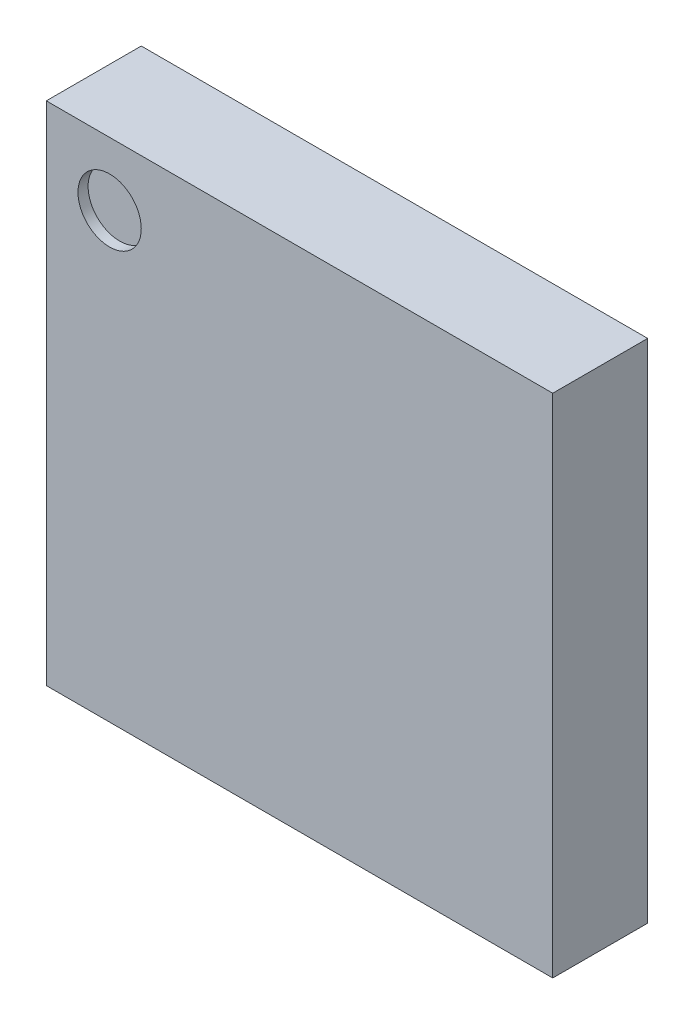
ISO-10303-21;
HEADER;
FILE_DESCRIPTION(('STEP AP214'),'2;1');
FILE_NAME('part.step','',(''),(''),'','','');
FILE_SCHEMA(('AUTOMOTIVE_DESIGN { 1 0 10303 214 1 1 1 1 }'));
ENDSEC;
DATA;
#1=APPLICATION_CONTEXT('core data for automotive mechanical design processes');
#2=APPLICATION_PROTOCOL_DEFINITION('international standard','automotive_design',2000,#1);
#3=PRODUCT_CONTEXT('',#1,'mechanical');
#4=PRODUCT('Part','Part','',(#3));
#5=PRODUCT_RELATED_PRODUCT_CATEGORY('part','',(#4));
#6=PRODUCT_DEFINITION_FORMATION('','',#4);
#7=PRODUCT_DEFINITION_CONTEXT('part definition',#1,'design');
#8=PRODUCT_DEFINITION('design','',#6,#7);
#9=PRODUCT_DEFINITION_SHAPE('','',#8);
#10=(LENGTH_UNIT() NAMED_UNIT(*) SI_UNIT(.MILLI.,.METRE.));
#11=(NAMED_UNIT(*) PLANE_ANGLE_UNIT() SI_UNIT($,.RADIAN.));
#12=(NAMED_UNIT(*) SI_UNIT($,.STERADIAN.) SOLID_ANGLE_UNIT());
#13=UNCERTAINTY_MEASURE_WITH_UNIT(LENGTH_MEASURE(1.E-05),#10,'distance_accuracy_value','');
#14=(GEOMETRIC_REPRESENTATION_CONTEXT(3) GLOBAL_UNCERTAINTY_ASSIGNED_CONTEXT((#13)) GLOBAL_UNIT_ASSIGNED_CONTEXT((#10,
#11,#12)) REPRESENTATION_CONTEXT('',''));
#15=CARTESIAN_POINT('',(0.,0.,0.));
#16=DIRECTION('',(0.,0.,1.));
#17=DIRECTION('',(1.,0.,0.));
#18=AXIS2_PLACEMENT_3D('',#15,#16,#17);
#19=CARTESIAN_POINT('',(-2.,-2.,0.05));
#20=DIRECTION('',(1.,0.,0.));
#21=DIRECTION('',(0.,0.,1.));
#22=AXIS2_PLACEMENT_3D('',#19,#20,#21);
#23=PLANE('',#22);
#24=DIRECTION('',(0.,1.,0.));
#25=VECTOR('',#24,1.);
#26=CARTESIAN_POINT('',(-2.,-2.,0.8));
#27=LINE('',#26,#25);
#28=CARTESIAN_POINT('',(-2.,-2.,0.8));
#29=VERTEX_POINT('',#28);
#30=CARTESIAN_POINT('',(-2.,2.,0.8));
#31=VERTEX_POINT('',#30);
#32=EDGE_CURVE('E11',#29,#31,#27,.T.);
#33=ORIENTED_EDGE('',*,*,#32,.T.);
#34=DIRECTION('',(0.,0.,1.));
#35=VECTOR('',#34,1.);
#36=CARTESIAN_POINT('',(-2.,2.,0.05));
#37=LINE('',#36,#35);
#38=CARTESIAN_POINT('',(-2.,2.,0.05));
#39=VERTEX_POINT('',#38);
#40=EDGE_CURVE('E24',#39,#31,#37,.T.);
#41=ORIENTED_EDGE('',*,*,#40,.F.);
#42=DIRECTION('',(0.,1.,0.));
#43=VECTOR('',#42,1.);
#44=CARTESIAN_POINT('',(-2.,-2.,0.05));
#45=LINE('',#44,#43);
#46=CARTESIAN_POINT('',(-2.,-2.,0.05));
#47=VERTEX_POINT('',#46);
#48=EDGE_CURVE('E95',#47,#39,#45,.T.);
#49=ORIENTED_EDGE('',*,*,#48,.F.);
#50=DIRECTION('',(0.,0.,1.));
#51=VECTOR('',#50,1.);
#52=CARTESIAN_POINT('',(-2.,-2.,0.05));
#53=LINE('',#52,#51);
#54=EDGE_CURVE('E36',#47,#29,#53,.T.);
#55=ORIENTED_EDGE('',*,*,#54,.T.);
#56=EDGE_LOOP('',(#33,#41,#49,#55));
#57=FACE_BOUND('',#56,.T.);
#58=ADVANCED_FACE('F17',(#57),#23,.F.);
#59=CARTESIAN_POINT('',(-2.,-2.,0.05));
#60=DIRECTION('',(0.,1.,0.));
#61=DIRECTION('',(0.,0.,1.));
#62=AXIS2_PLACEMENT_3D('',#59,#60,#61);
#63=PLANE('',#62);
#64=DIRECTION('',(0.,0.,1.));
#65=VECTOR('',#64,1.);
#66=CARTESIAN_POINT('',(2.,-2.,0.05));
#67=LINE('',#66,#65);
#68=CARTESIAN_POINT('',(2.,-2.,0.05));
#69=VERTEX_POINT('',#68);
#70=CARTESIAN_POINT('',(2.,-2.,0.8));
#71=VERTEX_POINT('',#70);
#72=EDGE_CURVE('E91',#69,#71,#67,.T.);
#73=ORIENTED_EDGE('',*,*,#72,.T.);
#74=DIRECTION('',(1.,0.,0.));
#75=VECTOR('',#74,1.);
#76=CARTESIAN_POINT('',(-2.,-2.,0.8));
#77=LINE('',#76,#75);
#78=EDGE_CURVE('E89',#29,#71,#77,.T.);
#79=ORIENTED_EDGE('',*,*,#78,.F.);
#80=ORIENTED_EDGE('',*,*,#54,.F.);
#81=DIRECTION('',(1.,0.,0.));
#82=VECTOR('',#81,1.);
#83=CARTESIAN_POINT('',(-2.,-2.,0.05));
#84=LINE('',#83,#82);
#85=EDGE_CURVE('E87',#47,#69,#84,.T.);
#86=ORIENTED_EDGE('',*,*,#85,.T.);
#87=EDGE_LOOP('',(#73,#79,#80,#86));
#88=FACE_BOUND('',#87,.T.);
#89=ADVANCED_FACE('F109',(#88),#63,.F.);
#90=CARTESIAN_POINT('',(-2.,-2.,0.8));
#91=DIRECTION('',(0.,0.,1.));
#92=DIRECTION('',(1.,0.,0.));
#93=AXIS2_PLACEMENT_3D('',#90,#91,#92);
#94=PLANE('',#93);
#95=ORIENTED_EDGE('',*,*,#32,.F.);
#96=ORIENTED_EDGE('',*,*,#78,.T.);
#97=DIRECTION('',(0.,1.,0.));
#98=VECTOR('',#97,1.);
#99=CARTESIAN_POINT('',(2.,-2.,0.8));
#100=LINE('',#99,#98);
#101=CARTESIAN_POINT('',(2.,2.,0.8));
#102=VERTEX_POINT('',#101);
#103=EDGE_CURVE('E85',#71,#102,#100,.T.);
#104=ORIENTED_EDGE('',*,*,#103,.T.);
#105=DIRECTION('',(1.,0.,0.));
#106=VECTOR('',#105,1.);
#107=CARTESIAN_POINT('',(-2.,2.,0.8));
#108=LINE('',#107,#106);
#109=EDGE_CURVE('E83',#31,#102,#108,.T.);
#110=ORIENTED_EDGE('',*,*,#109,.F.);
#111=EDGE_LOOP('',(#95,#96,#104,#110));
#112=FACE_BOUND('',#111,.T.);
#113=CARTESIAN_POINT('',(-1.5,1.5,0.8));
#114=DIRECTION('',(0.,0.,1.));
#115=DIRECTION('',(1.,0.,0.));
#116=AXIS2_PLACEMENT_3D('',#113,#114,#115);
#117=CIRCLE('',#116,0.25);
#118=CARTESIAN_POINT('',(-1.25,1.5,0.8));
#119=VERTEX_POINT('',#118);
#120=EDGE_CURVE('E68',#119,#119,#117,.T.);
#121=ORIENTED_EDGE('',*,*,#120,.F.);
#122=EDGE_LOOP('',(#121));
#123=FACE_BOUND('',#122,.T.);
#124=ADVANCED_FACE('F111',(#112,#123),#94,.T.);
#125=CARTESIAN_POINT('',(-2.,2.,0.05));
#126=DIRECTION('',(0.,1.,0.));
#127=DIRECTION('',(0.,0.,1.));
#128=AXIS2_PLACEMENT_3D('',#125,#126,#127);
#129=PLANE('',#128);
#130=DIRECTION('',(1.,0.,0.));
#131=VECTOR('',#130,1.);
#132=CARTESIAN_POINT('',(-2.,2.,0.05));
#133=LINE('',#132,#131);
#134=CARTESIAN_POINT('',(2.,2.,0.05));
#135=VERTEX_POINT('',#134);
#136=EDGE_CURVE('E80',#39,#135,#133,.T.);
#137=ORIENTED_EDGE('',*,*,#136,.F.);
#138=ORIENTED_EDGE('',*,*,#40,.T.);
#139=ORIENTED_EDGE('',*,*,#109,.T.);
#140=DIRECTION('',(0.,0.,1.));
#141=VECTOR('',#140,1.);
#142=CARTESIAN_POINT('',(2.,2.,0.05));
#143=LINE('',#142,#141);
#144=EDGE_CURVE('E75',#135,#102,#143,.T.);
#145=ORIENTED_EDGE('',*,*,#144,.F.);
#146=EDGE_LOOP('',(#137,#138,#139,#145));
#147=FACE_BOUND('',#146,.T.);
#148=ADVANCED_FACE('F102',(#147),#129,.T.);
#149=CARTESIAN_POINT('',(-2.,-2.,0.05));
#150=DIRECTION('',(0.,0.,1.));
#151=DIRECTION('',(1.,0.,0.));
#152=AXIS2_PLACEMENT_3D('',#149,#150,#151);
#153=PLANE('',#152);
#154=ORIENTED_EDGE('',*,*,#136,.T.);
#155=DIRECTION('',(0.,1.,0.));
#156=VECTOR('',#155,1.);
#157=CARTESIAN_POINT('',(2.,-2.,0.05));
#158=LINE('',#157,#156);
#159=EDGE_CURVE('E72',#69,#135,#158,.T.);
#160=ORIENTED_EDGE('',*,*,#159,.F.);
#161=ORIENTED_EDGE('',*,*,#85,.F.);
#162=ORIENTED_EDGE('',*,*,#48,.T.);
#163=EDGE_LOOP('',(#154,#160,#161,#162));
#164=FACE_BOUND('',#163,.T.);
#165=ADVANCED_FACE('F98',(#164),#153,.F.);
#166=CARTESIAN_POINT('',(2.,-2.,0.05));
#167=DIRECTION('',(1.,0.,0.));
#168=DIRECTION('',(0.,0.,1.));
#169=AXIS2_PLACEMENT_3D('',#166,#167,#168);
#170=PLANE('',#169);
#171=ORIENTED_EDGE('',*,*,#72,.F.);
#172=ORIENTED_EDGE('',*,*,#159,.T.);
#173=ORIENTED_EDGE('',*,*,#144,.T.);
#174=ORIENTED_EDGE('',*,*,#103,.F.);
#175=EDGE_LOOP('',(#171,#172,#173,#174));
#176=FACE_BOUND('',#175,.T.);
#177=ADVANCED_FACE('F106',(#176),#170,.T.);
#178=CARTESIAN_POINT('',(-1.5,1.5,0.72));
#179=DIRECTION('',(0.,0.,1.));
#180=DIRECTION('',(1.,0.,0.));
#181=AXIS2_PLACEMENT_3D('',#178,#179,#180);
#182=CYLINDRICAL_SURFACE('',#181,0.25);
#183=CARTESIAN_POINT('',(-1.5,1.5,0.72));
#184=DIRECTION('',(0.,0.,1.));
#185=DIRECTION('',(1.,0.,0.));
#186=AXIS2_PLACEMENT_3D('',#183,#184,#185);
#187=CIRCLE('',#186,0.25);
#188=CARTESIAN_POINT('',(-1.25,1.5,0.72));
#189=VERTEX_POINT('',#188);
#190=EDGE_CURVE('E66',#189,#189,#187,.T.);
#191=ORIENTED_EDGE('',*,*,#190,.F.);
#192=DIRECTION('',(0.,0.,1.));
#193=VECTOR('',#192,1.);
#194=CARTESIAN_POINT('',(-1.25,1.5,0.72));
#195=LINE('',#194,#193);
#196=EDGE_CURVE('E63',#189,#119,#195,.T.);
#197=ORIENTED_EDGE('',*,*,#196,.T.);
#198=ORIENTED_EDGE('',*,*,#120,.T.);
#199=ORIENTED_EDGE('',*,*,#196,.F.);
#200=EDGE_LOOP('',(#191,#197,#198,#199));
#201=FACE_BOUND('',#200,.T.);
#202=ADVANCED_FACE('F65',(#201),#182,.F.);
#203=CARTESIAN_POINT('',(-1.5,1.5,0.72));
#204=DIRECTION('',(0.,0.,1.));
#205=DIRECTION('',(1.,0.,0.));
#206=AXIS2_PLACEMENT_3D('',#203,#204,#205);
#207=PLANE('',#206);
#208=ORIENTED_EDGE('',*,*,#190,.T.);
#209=EDGE_LOOP('',(#208));
#210=FACE_BOUND('',#209,.T.);
#211=ADVANCED_FACE('F71',(#210),#207,.T.);
#212=CLOSED_SHELL('',(#58,#89,#124,#148,#165,#177,#202,#211));
#213=MANIFOLD_SOLID_BREP('B1',#212);
#214=ADVANCED_BREP_SHAPE_REPRESENTATION('',(#18,#213),#14);
#215=SHAPE_DEFINITION_REPRESENTATION(#9,#214);
ENDSEC;
END-ISO-10303-21;
